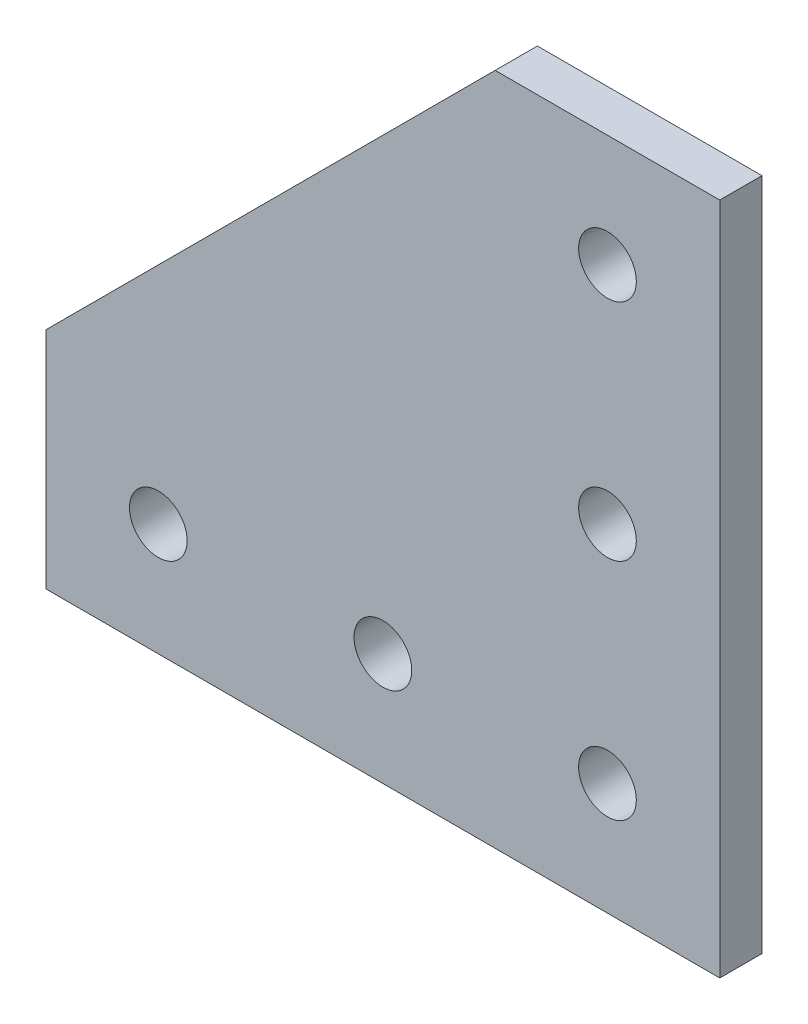
ISO-10303-21;
HEADER;
FILE_DESCRIPTION(('STEP AP214'),'2;1');
FILE_NAME('part.step','',(''),(''),'','','');
FILE_SCHEMA(('AUTOMOTIVE_DESIGN { 1 0 10303 214 1 1 1 1 }'));
ENDSEC;
DATA;
#1=APPLICATION_CONTEXT('core data for automotive mechanical design processes');
#2=APPLICATION_PROTOCOL_DEFINITION('international standard','automotive_design',2000,#1);
#3=PRODUCT_CONTEXT('',#1,'mechanical');
#4=PRODUCT('Part','Part','',(#3));
#5=PRODUCT_RELATED_PRODUCT_CATEGORY('part','',(#4));
#6=PRODUCT_DEFINITION_FORMATION('','',#4);
#7=PRODUCT_DEFINITION_CONTEXT('part definition',#1,'design');
#8=PRODUCT_DEFINITION('design','',#6,#7);
#9=PRODUCT_DEFINITION_SHAPE('','',#8);
#10=(LENGTH_UNIT() NAMED_UNIT(*) SI_UNIT(.MILLI.,.METRE.));
#11=(NAMED_UNIT(*) PLANE_ANGLE_UNIT() SI_UNIT($,.RADIAN.));
#12=(NAMED_UNIT(*) SI_UNIT($,.STERADIAN.) SOLID_ANGLE_UNIT());
#13=UNCERTAINTY_MEASURE_WITH_UNIT(LENGTH_MEASURE(1.E-05),#10,'distance_accuracy_value','');
#14=(GEOMETRIC_REPRESENTATION_CONTEXT(3) GLOBAL_UNCERTAINTY_ASSIGNED_CONTEXT((#13)) GLOBAL_UNIT_ASSIGNED_CONTEXT((#10,
#11,#12)) REPRESENTATION_CONTEXT('',''));
#15=CARTESIAN_POINT('',(0.,0.,0.));
#16=DIRECTION('',(0.,0.,1.));
#17=DIRECTION('',(1.,0.,0.));
#18=AXIS2_PLACEMENT_3D('',#15,#16,#17);
#19=CARTESIAN_POINT('',(0.,0.,4.7752));
#20=DIRECTION('',(0.,0.,1.));
#21=DIRECTION('',(1.,0.,0.));
#22=AXIS2_PLACEMENT_3D('',#19,#20,#21);
#23=PLANE('',#22);
#24=CARTESIAN_POINT('',(0.,12.7,4.7752));
#25=DIRECTION('',(0.,0.,1.));
#26=DIRECTION('',(1.,0.,0.));
#27=AXIS2_PLACEMENT_3D('',#24,#25,#26);
#28=CIRCLE('',#27,3.2639);
#29=CARTESIAN_POINT('',(3.2639,12.7,4.7752));
#30=VERTEX_POINT('',#29);
#31=EDGE_CURVE('E177',#30,#30,#28,.T.);
#32=ORIENTED_EDGE('',*,*,#31,.F.);
#33=EDGE_LOOP('',(#32));
#34=FACE_BOUND('',#33,.T.);
#35=CARTESIAN_POINT('',(25.4,38.1,4.7752));
#36=DIRECTION('',(0.,0.,1.));
#37=DIRECTION('',(1.,0.,0.));
#38=AXIS2_PLACEMENT_3D('',#35,#36,#37);
#39=CIRCLE('',#38,3.2639);
#40=CARTESIAN_POINT('',(28.6639,38.1,4.7752));
#41=VERTEX_POINT('',#40);
#42=EDGE_CURVE('E189',#41,#41,#39,.T.);
#43=ORIENTED_EDGE('',*,*,#42,.F.);
#44=EDGE_LOOP('',(#43));
#45=FACE_BOUND('',#44,.T.);
#46=DIRECTION('',(0.,-1.,0.));
#47=VECTOR('',#46,1.);
#48=CARTESIAN_POINT('',(-38.1,25.4,4.7752));
#49=LINE('',#48,#47);
#50=CARTESIAN_POINT('',(-38.1,25.4,4.7752));
#51=VERTEX_POINT('',#50);
#52=CARTESIAN_POINT('',(-38.1,0.,4.7752));
#53=VERTEX_POINT('',#52);
#54=EDGE_CURVE('E117',#51,#53,#49,.T.);
#55=ORIENTED_EDGE('',*,*,#54,.T.);
#56=DIRECTION('',(1.,0.,0.));
#57=VECTOR('',#56,1.);
#58=CARTESIAN_POINT('',(-38.1,0.,4.7752));
#59=LINE('',#58,#57);
#60=CARTESIAN_POINT('',(38.1,0.,4.7752));
#61=VERTEX_POINT('',#60);
#62=EDGE_CURVE('E84',#53,#61,#59,.T.);
#63=ORIENTED_EDGE('',*,*,#62,.T.);
#64=DIRECTION('',(0.,1.,0.));
#65=VECTOR('',#64,1.);
#66=CARTESIAN_POINT('',(38.1,0.,4.7752));
#67=LINE('',#66,#65);
#68=CARTESIAN_POINT('',(38.1,76.2,4.7752));
#69=VERTEX_POINT('',#68);
#70=EDGE_CURVE('E88',#61,#69,#67,.T.);
#71=ORIENTED_EDGE('',*,*,#70,.T.);
#72=DIRECTION('',(-1.,0.,0.));
#73=VECTOR('',#72,1.);
#74=CARTESIAN_POINT('',(38.1,76.2,4.7752));
#75=LINE('',#74,#73);
#76=CARTESIAN_POINT('',(12.7,76.2,4.7752));
#77=VERTEX_POINT('',#76);
#78=EDGE_CURVE('E92',#69,#77,#75,.T.);
#79=ORIENTED_EDGE('',*,*,#78,.T.);
#80=DIRECTION('',(-0.707106781186547,-0.707106781186548,0.));
#81=VECTOR('',#80,1.);
#82=CARTESIAN_POINT('',(12.7,76.2,4.7752));
#83=LINE('',#82,#81);
#84=EDGE_CURVE('E50',#77,#51,#83,.T.);
#85=ORIENTED_EDGE('',*,*,#84,.T.);
#86=EDGE_LOOP('',(#55,#63,#71,#79,#85));
#87=FACE_BOUND('',#86,.T.);
#88=CARTESIAN_POINT('',(25.4,63.5,4.7752));
#89=DIRECTION('',(0.,0.,1.));
#90=DIRECTION('',(1.,0.,0.));
#91=AXIS2_PLACEMENT_3D('',#88,#89,#90);
#92=CIRCLE('',#91,3.2639);
#93=CARTESIAN_POINT('',(28.6639,63.5,4.7752));
#94=VERTEX_POINT('',#93);
#95=EDGE_CURVE('E112',#94,#94,#92,.T.);
#96=ORIENTED_EDGE('',*,*,#95,.F.);
#97=EDGE_LOOP('',(#96));
#98=FACE_BOUND('',#97,.T.);
#99=CARTESIAN_POINT('',(25.4,12.7,4.7752));
#100=DIRECTION('',(0.,0.,1.));
#101=DIRECTION('',(1.,0.,0.));
#102=AXIS2_PLACEMENT_3D('',#99,#100,#101);
#103=CIRCLE('',#102,3.2639);
#104=CARTESIAN_POINT('',(28.6639,12.7,4.7752));
#105=VERTEX_POINT('',#104);
#106=EDGE_CURVE('E183',#105,#105,#103,.T.);
#107=ORIENTED_EDGE('',*,*,#106,.F.);
#108=EDGE_LOOP('',(#107));
#109=FACE_BOUND('',#108,.T.);
#110=CARTESIAN_POINT('',(-25.4,12.7,4.7752));
#111=DIRECTION('',(0.,0.,1.));
#112=DIRECTION('',(1.,0.,0.));
#113=AXIS2_PLACEMENT_3D('',#110,#111,#112);
#114=CIRCLE('',#113,3.2639);
#115=CARTESIAN_POINT('',(-22.1361,12.7,4.7752));
#116=VERTEX_POINT('',#115);
#117=EDGE_CURVE('E168',#116,#116,#114,.T.);
#118=ORIENTED_EDGE('',*,*,#117,.F.);
#119=EDGE_LOOP('',(#118));
#120=FACE_BOUND('',#119,.T.);
#121=ADVANCED_FACE('F33',(#34,#45,#87,#98,#109,#120),#23,.T.);
#122=CARTESIAN_POINT('',(0.,0.,0.));
#123=DIRECTION('',(0.,0.,1.));
#124=DIRECTION('',(1.,0.,0.));
#125=AXIS2_PLACEMENT_3D('',#122,#123,#124);
#126=PLANE('',#125);
#127=CARTESIAN_POINT('',(0.,12.7,0.));
#128=DIRECTION('',(0.,0.,1.));
#129=DIRECTION('',(1.,0.,0.));
#130=AXIS2_PLACEMENT_3D('',#127,#128,#129);
#131=CIRCLE('',#130,3.2639);
#132=CARTESIAN_POINT('',(3.2639,12.7,0.));
#133=VERTEX_POINT('',#132);
#134=EDGE_CURVE('E174',#133,#133,#131,.T.);
#135=ORIENTED_EDGE('',*,*,#134,.T.);
#136=EDGE_LOOP('',(#135));
#137=FACE_BOUND('',#136,.T.);
#138=CARTESIAN_POINT('',(25.4,38.1,0.));
#139=DIRECTION('',(0.,0.,1.));
#140=DIRECTION('',(1.,0.,0.));
#141=AXIS2_PLACEMENT_3D('',#138,#139,#140);
#142=CIRCLE('',#141,3.2639);
#143=CARTESIAN_POINT('',(28.6639,38.1,0.));
#144=VERTEX_POINT('',#143);
#145=EDGE_CURVE('E186',#144,#144,#142,.T.);
#146=ORIENTED_EDGE('',*,*,#145,.T.);
#147=EDGE_LOOP('',(#146));
#148=FACE_BOUND('',#147,.T.);
#149=DIRECTION('',(0.,-1.,0.));
#150=VECTOR('',#149,1.);
#151=CARTESIAN_POINT('',(-38.1,25.4,0.));
#152=LINE('',#151,#150);
#153=CARTESIAN_POINT('',(-38.1,25.4,0.));
#154=VERTEX_POINT('',#153);
#155=CARTESIAN_POINT('',(-38.1,0.,0.));
#156=VERTEX_POINT('',#155);
#157=EDGE_CURVE('E108',#154,#156,#152,.T.);
#158=ORIENTED_EDGE('',*,*,#157,.F.);
#159=DIRECTION('',(-0.707106781186547,-0.707106781186548,0.));
#160=VECTOR('',#159,1.);
#161=CARTESIAN_POINT('',(12.7,76.2,0.));
#162=LINE('',#161,#160);
#163=CARTESIAN_POINT('',(12.7,76.2,0.));
#164=VERTEX_POINT('',#163);
#165=EDGE_CURVE('E76',#164,#154,#162,.T.);
#166=ORIENTED_EDGE('',*,*,#165,.F.);
#167=DIRECTION('',(-1.,0.,0.));
#168=VECTOR('',#167,1.);
#169=CARTESIAN_POINT('',(38.1,76.2,0.));
#170=LINE('',#169,#168);
#171=CARTESIAN_POINT('',(38.1,76.2,0.));
#172=VERTEX_POINT('',#171);
#173=EDGE_CURVE('E70',#172,#164,#170,.T.);
#174=ORIENTED_EDGE('',*,*,#173,.F.);
#175=DIRECTION('',(0.,1.,0.));
#176=VECTOR('',#175,1.);
#177=CARTESIAN_POINT('',(38.1,0.,0.));
#178=LINE('',#177,#176);
#179=CARTESIAN_POINT('',(38.1,0.,0.));
#180=VERTEX_POINT('',#179);
#181=EDGE_CURVE('E99',#180,#172,#178,.T.);
#182=ORIENTED_EDGE('',*,*,#181,.F.);
#183=DIRECTION('',(1.,0.,0.));
#184=VECTOR('',#183,1.);
#185=CARTESIAN_POINT('',(-38.1,0.,0.));
#186=LINE('',#185,#184);
#187=EDGE_CURVE('E111',#156,#180,#186,.T.);
#188=ORIENTED_EDGE('',*,*,#187,.F.);
#189=EDGE_LOOP('',(#158,#166,#174,#182,#188));
#190=FACE_BOUND('',#189,.T.);
#191=CARTESIAN_POINT('',(25.4,63.5,0.));
#192=DIRECTION('',(0.,0.,1.));
#193=DIRECTION('',(1.,0.,0.));
#194=AXIS2_PLACEMENT_3D('',#191,#192,#193);
#195=CIRCLE('',#194,3.2639);
#196=CARTESIAN_POINT('',(28.6639,63.5,0.));
#197=VERTEX_POINT('',#196);
#198=EDGE_CURVE('E192',#197,#197,#195,.T.);
#199=ORIENTED_EDGE('',*,*,#198,.T.);
#200=EDGE_LOOP('',(#199));
#201=FACE_BOUND('',#200,.T.);
#202=CARTESIAN_POINT('',(25.4,12.7,0.));
#203=DIRECTION('',(0.,0.,1.));
#204=DIRECTION('',(1.,0.,0.));
#205=AXIS2_PLACEMENT_3D('',#202,#203,#204);
#206=CIRCLE('',#205,3.2639);
#207=CARTESIAN_POINT('',(28.6639,12.7,0.));
#208=VERTEX_POINT('',#207);
#209=EDGE_CURVE('E180',#208,#208,#206,.T.);
#210=ORIENTED_EDGE('',*,*,#209,.T.);
#211=EDGE_LOOP('',(#210));
#212=FACE_BOUND('',#211,.T.);
#213=CARTESIAN_POINT('',(-25.4,12.7,0.));
#214=DIRECTION('',(0.,0.,1.));
#215=DIRECTION('',(1.,0.,0.));
#216=AXIS2_PLACEMENT_3D('',#213,#214,#215);
#217=CIRCLE('',#216,3.2639);
#218=CARTESIAN_POINT('',(-22.1361,12.7,0.));
#219=VERTEX_POINT('',#218);
#220=EDGE_CURVE('E171',#219,#219,#217,.T.);
#221=ORIENTED_EDGE('',*,*,#220,.T.);
#222=EDGE_LOOP('',(#221));
#223=FACE_BOUND('',#222,.T.);
#224=ADVANCED_FACE('F121',(#137,#148,#190,#201,#212,#223),#126,.F.);
#225=CARTESIAN_POINT('',(-38.1,25.4,4.7752));
#226=DIRECTION('',(1.,0.,0.));
#227=DIRECTION('',(0.,0.,-1.));
#228=AXIS2_PLACEMENT_3D('',#225,#226,#227);
#229=PLANE('',#228);
#230=ORIENTED_EDGE('',*,*,#157,.T.);
#231=DIRECTION('',(0.,0.,-1.));
#232=VECTOR('',#231,1.);
#233=CARTESIAN_POINT('',(-38.1,0.,4.7752));
#234=LINE('',#233,#232);
#235=EDGE_CURVE('E11',#53,#156,#234,.T.);
#236=ORIENTED_EDGE('',*,*,#235,.F.);
#237=ORIENTED_EDGE('',*,*,#54,.F.);
#238=DIRECTION('',(0.,0.,-1.));
#239=VECTOR('',#238,1.);
#240=CARTESIAN_POINT('',(-38.1,25.4,4.7752));
#241=LINE('',#240,#239);
#242=EDGE_CURVE('E104',#51,#154,#241,.T.);
#243=ORIENTED_EDGE('',*,*,#242,.T.);
#244=EDGE_LOOP('',(#230,#236,#237,#243));
#245=FACE_BOUND('',#244,.T.);
#246=ADVANCED_FACE('F35',(#245),#229,.F.);
#247=CARTESIAN_POINT('',(-38.1,0.,4.7752));
#248=DIRECTION('',(0.,1.,0.));
#249=DIRECTION('',(0.,0.,1.));
#250=AXIS2_PLACEMENT_3D('',#247,#248,#249);
#251=PLANE('',#250);
#252=ORIENTED_EDGE('',*,*,#187,.T.);
#253=DIRECTION('',(0.,0.,-1.));
#254=VECTOR('',#253,1.);
#255=CARTESIAN_POINT('',(38.1,0.,4.7752));
#256=LINE('',#255,#254);
#257=EDGE_CURVE('E42',#61,#180,#256,.T.);
#258=ORIENTED_EDGE('',*,*,#257,.F.);
#259=ORIENTED_EDGE('',*,*,#62,.F.);
#260=ORIENTED_EDGE('',*,*,#235,.T.);
#261=EDGE_LOOP('',(#252,#258,#259,#260));
#262=FACE_BOUND('',#261,.T.);
#263=ADVANCED_FACE('F249',(#262),#251,.F.);
#264=CARTESIAN_POINT('',(38.1,0.,4.7752));
#265=DIRECTION('',(-1.,0.,0.));
#266=DIRECTION('',(0.,0.,1.));
#267=AXIS2_PLACEMENT_3D('',#264,#265,#266);
#268=PLANE('',#267);
#269=ORIENTED_EDGE('',*,*,#181,.T.);
#270=DIRECTION('',(0.,0.,-1.));
#271=VECTOR('',#270,1.);
#272=CARTESIAN_POINT('',(38.1,76.2,4.7752));
#273=LINE('',#272,#271);
#274=EDGE_CURVE('E96',#69,#172,#273,.T.);
#275=ORIENTED_EDGE('',*,*,#274,.F.);
#276=ORIENTED_EDGE('',*,*,#70,.F.);
#277=ORIENTED_EDGE('',*,*,#257,.T.);
#278=EDGE_LOOP('',(#269,#275,#276,#277));
#279=FACE_BOUND('',#278,.T.);
#280=ADVANCED_FACE('F97',(#279),#268,.F.);
#281=CARTESIAN_POINT('',(38.1,76.2,4.7752));
#282=DIRECTION('',(0.,-1.,0.));
#283=DIRECTION('',(0.,0.,-1.));
#284=AXIS2_PLACEMENT_3D('',#281,#282,#283);
#285=PLANE('',#284);
#286=ORIENTED_EDGE('',*,*,#173,.T.);
#287=DIRECTION('',(0.,0.,-1.));
#288=VECTOR('',#287,1.);
#289=CARTESIAN_POINT('',(12.7,76.2,4.7752));
#290=LINE('',#289,#288);
#291=EDGE_CURVE('E100',#77,#164,#290,.T.);
#292=ORIENTED_EDGE('',*,*,#291,.F.);
#293=ORIENTED_EDGE('',*,*,#78,.F.);
#294=ORIENTED_EDGE('',*,*,#274,.T.);
#295=EDGE_LOOP('',(#286,#292,#293,#294));
#296=FACE_BOUND('',#295,.T.);
#297=ADVANCED_FACE('F102',(#296),#285,.F.);
#298=CARTESIAN_POINT('',(12.7,76.2,4.7752));
#299=DIRECTION('',(0.707106781186548,-0.707106781186547,0.));
#300=DIRECTION('',(0.707106781186547,0.707106781186548,0.));
#301=AXIS2_PLACEMENT_3D('',#298,#299,#300);
#302=PLANE('',#301);
#303=ORIENTED_EDGE('',*,*,#165,.T.);
#304=ORIENTED_EDGE('',*,*,#242,.F.);
#305=ORIENTED_EDGE('',*,*,#84,.F.);
#306=ORIENTED_EDGE('',*,*,#291,.T.);
#307=EDGE_LOOP('',(#303,#304,#305,#306));
#308=FACE_BOUND('',#307,.T.);
#309=ADVANCED_FACE('F126',(#308),#302,.F.);
#310=CARTESIAN_POINT('',(25.4,63.5,4.7752));
#311=DIRECTION('',(0.,0.,-1.));
#312=DIRECTION('',(-1.,0.,0.));
#313=AXIS2_PLACEMENT_3D('',#310,#311,#312);
#314=CYLINDRICAL_SURFACE('',#313,3.2639);
#315=ORIENTED_EDGE('',*,*,#95,.T.);
#316=EDGE_LOOP('',(#315));
#317=FACE_BOUND('',#316,.T.);
#318=ORIENTED_EDGE('',*,*,#198,.F.);
#319=EDGE_LOOP('',(#318));
#320=FACE_BOUND('',#319,.T.);
#321=ADVANCED_FACE('F128',(#317,#320),#314,.F.);
#322=CARTESIAN_POINT('',(25.4,38.1,4.7752));
#323=DIRECTION('',(0.,0.,-1.));
#324=DIRECTION('',(-1.,0.,0.));
#325=AXIS2_PLACEMENT_3D('',#322,#323,#324);
#326=CYLINDRICAL_SURFACE('',#325,3.2639);
#327=ORIENTED_EDGE('',*,*,#42,.T.);
#328=EDGE_LOOP('',(#327));
#329=FACE_BOUND('',#328,.T.);
#330=ORIENTED_EDGE('',*,*,#145,.F.);
#331=EDGE_LOOP('',(#330));
#332=FACE_BOUND('',#331,.T.);
#333=ADVANCED_FACE('F134',(#329,#332),#326,.F.);
#334=CARTESIAN_POINT('',(25.4,12.7,4.7752));
#335=DIRECTION('',(0.,0.,-1.));
#336=DIRECTION('',(-1.,0.,0.));
#337=AXIS2_PLACEMENT_3D('',#334,#335,#336);
#338=CYLINDRICAL_SURFACE('',#337,3.2639);
#339=ORIENTED_EDGE('',*,*,#106,.T.);
#340=EDGE_LOOP('',(#339));
#341=FACE_BOUND('',#340,.T.);
#342=ORIENTED_EDGE('',*,*,#209,.F.);
#343=EDGE_LOOP('',(#342));
#344=FACE_BOUND('',#343,.T.);
#345=ADVANCED_FACE('F151',(#341,#344),#338,.F.);
#346=CARTESIAN_POINT('',(0.,12.7,4.7752));
#347=DIRECTION('',(0.,0.,-1.));
#348=DIRECTION('',(-1.,0.,0.));
#349=AXIS2_PLACEMENT_3D('',#346,#347,#348);
#350=CYLINDRICAL_SURFACE('',#349,3.2639);
#351=ORIENTED_EDGE('',*,*,#31,.T.);
#352=EDGE_LOOP('',(#351));
#353=FACE_BOUND('',#352,.T.);
#354=ORIENTED_EDGE('',*,*,#134,.F.);
#355=EDGE_LOOP('',(#354));
#356=FACE_BOUND('',#355,.T.);
#357=ADVANCED_FACE('F155',(#353,#356),#350,.F.);
#358=CARTESIAN_POINT('',(-25.4,12.7,4.7752));
#359=DIRECTION('',(0.,0.,-1.));
#360=DIRECTION('',(-1.,0.,0.));
#361=AXIS2_PLACEMENT_3D('',#358,#359,#360);
#362=CYLINDRICAL_SURFACE('',#361,3.2639);
#363=ORIENTED_EDGE('',*,*,#117,.T.);
#364=EDGE_LOOP('',(#363));
#365=FACE_BOUND('',#364,.T.);
#366=ORIENTED_EDGE('',*,*,#220,.F.);
#367=EDGE_LOOP('',(#366));
#368=FACE_BOUND('',#367,.T.);
#369=ADVANCED_FACE('F159',(#365,#368),#362,.F.);
#370=CLOSED_SHELL('',(#121,#224,#246,#263,#280,#297,#309,#321,#333,#345,#357,#369));
#371=MANIFOLD_SOLID_BREP('B2',#370);
#372=ADVANCED_BREP_SHAPE_REPRESENTATION('',(#18,#371),#14);
#373=SHAPE_DEFINITION_REPRESENTATION(#9,#372);
ENDSEC;
END-ISO-10303-21;
